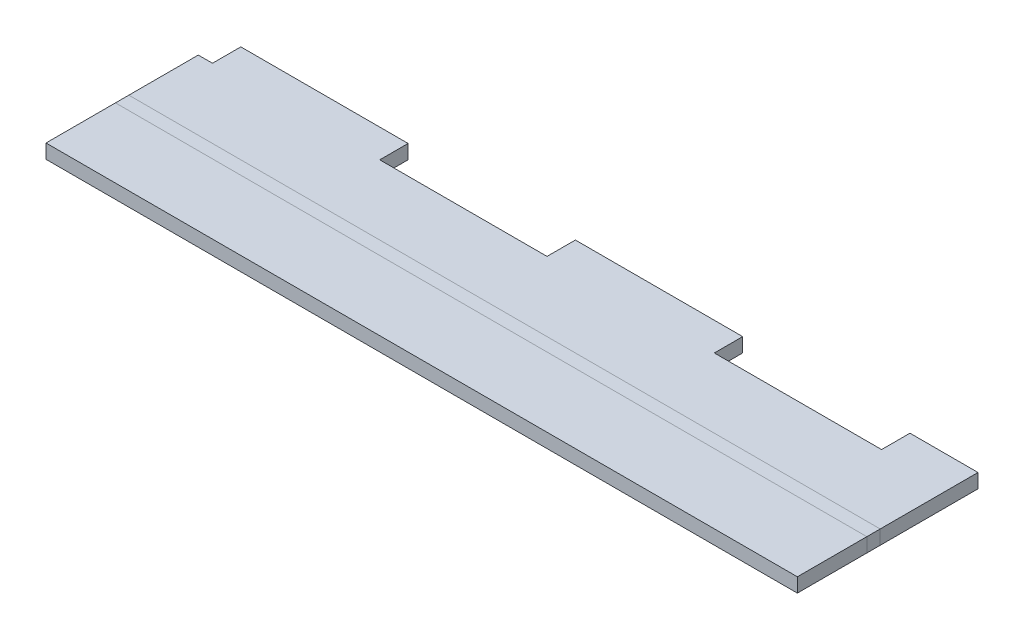
ISO-10303-21;
HEADER;
FILE_DESCRIPTION(('STEP AP214'),'2;1');
FILE_NAME('part.step','',(''),(''),'','','');
FILE_SCHEMA(('AUTOMOTIVE_DESIGN { 1 0 10303 214 1 1 1 1 }'));
ENDSEC;
DATA;
#1=APPLICATION_CONTEXT('core data for automotive mechanical design processes');
#2=APPLICATION_PROTOCOL_DEFINITION('international standard','automotive_design',2000,#1);
#3=PRODUCT_CONTEXT('',#1,'mechanical');
#4=PRODUCT('Part','Part','',(#3));
#5=PRODUCT_RELATED_PRODUCT_CATEGORY('part','',(#4));
#6=PRODUCT_DEFINITION_FORMATION('','',#4);
#7=PRODUCT_DEFINITION_CONTEXT('part definition',#1,'design');
#8=PRODUCT_DEFINITION('design','',#6,#7);
#9=PRODUCT_DEFINITION_SHAPE('','',#8);
#10=(LENGTH_UNIT() NAMED_UNIT(*) SI_UNIT(.MILLI.,.METRE.));
#11=(NAMED_UNIT(*) PLANE_ANGLE_UNIT() SI_UNIT($,.RADIAN.));
#12=(NAMED_UNIT(*) SI_UNIT($,.STERADIAN.) SOLID_ANGLE_UNIT());
#13=UNCERTAINTY_MEASURE_WITH_UNIT(LENGTH_MEASURE(1.E-05),#10,'distance_accuracy_value','');
#14=(GEOMETRIC_REPRESENTATION_CONTEXT(3) GLOBAL_UNCERTAINTY_ASSIGNED_CONTEXT((#13)) GLOBAL_UNIT_ASSIGNED_CONTEXT((#10,
#11,#12)) REPRESENTATION_CONTEXT('',''));
#15=CARTESIAN_POINT('',(0.,0.,0.));
#16=DIRECTION('',(0.,0.,1.));
#17=DIRECTION('',(1.,0.,0.));
#18=AXIS2_PLACEMENT_3D('',#15,#16,#17);
#19=CARTESIAN_POINT('',(6.731,2.032,-1.96658936020354));
#20=DIRECTION('',(1.,0.,0.));
#21=DIRECTION('',(0.,0.,1.));
#22=AXIS2_PLACEMENT_3D('',#19,#20,#21);
#23=PLANE('',#22);
#24=DIRECTION('',(0.,1.,0.));
#25=VECTOR('',#24,1.);
#26=CARTESIAN_POINT('',(6.731,2.032,-0.213989360203542));
#27=LINE('',#26,#25);
#28=CARTESIAN_POINT('',(6.731,1.778,-0.213989360203542));
#29=VERTEX_POINT('',#28);
#30=CARTESIAN_POINT('',(6.731,2.032,-0.213989360203542));
#31=VERTEX_POINT('',#30);
#32=EDGE_CURVE('E11',#29,#31,#27,.T.);
#33=ORIENTED_EDGE('',*,*,#32,.F.);
#34=DIRECTION('',(0.,0.,1.));
#35=VECTOR('',#34,1.);
#36=CARTESIAN_POINT('',(6.731,1.778,-1.96658936020354));
#37=LINE('',#36,#35);
#38=CARTESIAN_POINT('',(6.731,1.778,-1.96658936020354));
#39=VERTEX_POINT('',#38);
#40=EDGE_CURVE('E55',#39,#29,#37,.T.);
#41=ORIENTED_EDGE('',*,*,#40,.F.);
#42=DIRECTION('',(0.,1.,0.));
#43=VECTOR('',#42,1.);
#44=CARTESIAN_POINT('',(6.731,2.032,-1.96658936020354));
#45=LINE('',#44,#43);
#46=CARTESIAN_POINT('',(6.731,2.032,-1.96658936020354));
#47=VERTEX_POINT('',#46);
#48=EDGE_CURVE('E319',#39,#47,#45,.T.);
#49=ORIENTED_EDGE('',*,*,#48,.T.);
#50=DIRECTION('',(0.,0.,1.));
#51=VECTOR('',#50,1.);
#52=CARTESIAN_POINT('',(6.731,2.032,-1.96658936020354));
#53=LINE('',#52,#51);
#54=EDGE_CURVE('E238',#47,#31,#53,.T.);
#55=ORIENTED_EDGE('',*,*,#54,.T.);
#56=EDGE_LOOP('',(#33,#41,#49,#55));
#57=FACE_BOUND('',#56,.T.);
#58=ADVANCED_FACE('F41',(#57),#23,.T.);
#59=CARTESIAN_POINT('',(6.731,2.032,-1.96658936020354));
#60=DIRECTION('',(0.,0.,1.));
#61=DIRECTION('',(-1.,0.,0.));
#62=AXIS2_PLACEMENT_3D('',#59,#60,#61);
#63=PLANE('',#62);
#64=ORIENTED_EDGE('',*,*,#48,.F.);
#65=DIRECTION('',(1.,0.,0.));
#66=VECTOR('',#65,1.);
#67=CARTESIAN_POINT('',(6.731,1.778,-1.96658936020354));
#68=LINE('',#67,#66);
#69=CARTESIAN_POINT('',(5.51179999999999,1.778,-1.96658936020354));
#70=VERTEX_POINT('',#69);
#71=EDGE_CURVE('E293',#39,#70,#68,.F.);
#72=ORIENTED_EDGE('',*,*,#71,.T.);
#73=DIRECTION('',(0.,1.,0.));
#74=VECTOR('',#73,1.);
#75=CARTESIAN_POINT('',(5.51179999999999,2.032,-1.96658936020354));
#76=LINE('',#75,#74);
#77=CARTESIAN_POINT('',(5.51179999999999,2.032,-1.96658936020354));
#78=VERTEX_POINT('',#77);
#79=EDGE_CURVE('E317',#70,#78,#76,.T.);
#80=ORIENTED_EDGE('',*,*,#79,.T.);
#81=DIRECTION('',(-1.,0.,0.));
#82=VECTOR('',#81,1.);
#83=CARTESIAN_POINT('',(6.731,2.032,-1.96658936020354));
#84=LINE('',#83,#82);
#85=EDGE_CURVE('E241',#47,#78,#84,.T.);
#86=ORIENTED_EDGE('',*,*,#85,.F.);
#87=EDGE_LOOP('',(#64,#72,#80,#86));
#88=FACE_BOUND('',#87,.T.);
#89=ADVANCED_FACE('F352',(#88),#63,.F.);
#90=CARTESIAN_POINT('',(5.51179999999999,2.032,-1.96658936020354));
#91=DIRECTION('',(-1.,0.,0.));
#92=DIRECTION('',(0.,0.,-1.));
#93=AXIS2_PLACEMENT_3D('',#90,#91,#92);
#94=PLANE('',#93);
#95=ORIENTED_EDGE('',*,*,#79,.F.);
#96=DIRECTION('',(0.,0.,1.));
#97=VECTOR('',#96,1.);
#98=CARTESIAN_POINT('',(5.51179999999999,1.778,-1.96658936020354));
#99=LINE('',#98,#97);
#100=CARTESIAN_POINT('',(5.51179999999999,1.778,-1.45858936020354));
#101=VERTEX_POINT('',#100);
#102=EDGE_CURVE('E290',#101,#70,#99,.F.);
#103=ORIENTED_EDGE('',*,*,#102,.F.);
#104=DIRECTION('',(0.,1.,0.));
#105=VECTOR('',#104,1.);
#106=CARTESIAN_POINT('',(5.51179999999999,2.032,-1.45858936020354));
#107=LINE('',#106,#105);
#108=CARTESIAN_POINT('',(5.51179999999999,2.032,-1.45858936020354));
#109=VERTEX_POINT('',#108);
#110=EDGE_CURVE('E315',#101,#109,#107,.T.);
#111=ORIENTED_EDGE('',*,*,#110,.T.);
#112=DIRECTION('',(0.,0.,-1.));
#113=VECTOR('',#112,1.);
#114=CARTESIAN_POINT('',(5.51179999999999,2.032,-1.96658936020354));
#115=LINE('',#114,#113);
#116=EDGE_CURVE('E244',#109,#78,#115,.T.);
#117=ORIENTED_EDGE('',*,*,#116,.T.);
#118=EDGE_LOOP('',(#95,#103,#111,#117));
#119=FACE_BOUND('',#118,.T.);
#120=ADVANCED_FACE('F357',(#119),#94,.T.);
#121=CARTESIAN_POINT('',(5.51179999999999,2.032,-1.45858936020354));
#122=DIRECTION('',(0.,0.,-1.));
#123=DIRECTION('',(1.,0.,0.));
#124=AXIS2_PLACEMENT_3D('',#121,#122,#123);
#125=PLANE('',#124);
#126=ORIENTED_EDGE('',*,*,#110,.F.);
#127=DIRECTION('',(1.,0.,0.));
#128=VECTOR('',#127,1.);
#129=CARTESIAN_POINT('',(6.731,1.778,-1.45858936020354));
#130=LINE('',#129,#128);
#131=CARTESIAN_POINT('',(2.51459999999999,1.778,-1.45858936020354));
#132=VERTEX_POINT('',#131);
#133=EDGE_CURVE('E287',#132,#101,#130,.T.);
#134=ORIENTED_EDGE('',*,*,#133,.F.);
#135=DIRECTION('',(0.,1.,0.));
#136=VECTOR('',#135,1.);
#137=CARTESIAN_POINT('',(2.51459999999999,2.032,-1.45858936020354));
#138=LINE('',#137,#136);
#139=CARTESIAN_POINT('',(2.51459999999999,2.032,-1.45858936020354));
#140=VERTEX_POINT('',#139);
#141=EDGE_CURVE('E313',#132,#140,#138,.T.);
#142=ORIENTED_EDGE('',*,*,#141,.T.);
#143=DIRECTION('',(1.,0.,0.));
#144=VECTOR('',#143,1.);
#145=CARTESIAN_POINT('',(5.51179999999999,2.032,-1.45858936020354));
#146=LINE('',#145,#144);
#147=EDGE_CURVE('E249',#140,#109,#146,.T.);
#148=ORIENTED_EDGE('',*,*,#147,.T.);
#149=EDGE_LOOP('',(#126,#134,#142,#148));
#150=FACE_BOUND('',#149,.T.);
#151=ADVANCED_FACE('F373',(#150),#125,.T.);
#152=CARTESIAN_POINT('',(2.51459999999999,2.032,-1.96658936020354));
#153=DIRECTION('',(1.,0.,0.));
#154=DIRECTION('',(0.,0.,1.));
#155=AXIS2_PLACEMENT_3D('',#152,#153,#154);
#156=PLANE('',#155);
#157=ORIENTED_EDGE('',*,*,#141,.F.);
#158=DIRECTION('',(0.,0.,1.));
#159=VECTOR('',#158,1.);
#160=CARTESIAN_POINT('',(2.51459999999999,1.778,-1.96658936020354));
#161=LINE('',#160,#159);
#162=CARTESIAN_POINT('',(2.51459999999999,1.778,-1.96658936020354));
#163=VERTEX_POINT('',#162);
#164=EDGE_CURVE('E284',#163,#132,#161,.T.);
#165=ORIENTED_EDGE('',*,*,#164,.F.);
#166=DIRECTION('',(0.,1.,0.));
#167=VECTOR('',#166,1.);
#168=CARTESIAN_POINT('',(2.51459999999999,2.032,-1.96658936020354));
#169=LINE('',#168,#167);
#170=CARTESIAN_POINT('',(2.51459999999999,2.032,-1.96658936020354));
#171=VERTEX_POINT('',#170);
#172=EDGE_CURVE('E311',#163,#171,#169,.T.);
#173=ORIENTED_EDGE('',*,*,#172,.T.);
#174=DIRECTION('',(0.,0.,1.));
#175=VECTOR('',#174,1.);
#176=CARTESIAN_POINT('',(2.51459999999999,2.032,-1.96658936020354));
#177=LINE('',#176,#175);
#178=EDGE_CURVE('E252',#171,#140,#177,.T.);
#179=ORIENTED_EDGE('',*,*,#178,.T.);
#180=EDGE_LOOP('',(#157,#165,#173,#179));
#181=FACE_BOUND('',#180,.T.);
#182=ADVANCED_FACE('F379',(#181),#156,.T.);
#183=ORIENTED_EDGE('',*,*,#172,.F.);
#184=DIRECTION('',(1.,0.,0.));
#185=VECTOR('',#184,1.);
#186=CARTESIAN_POINT('',(6.731,1.778,-1.96658936020354));
#187=LINE('',#186,#185);
#188=CARTESIAN_POINT('',(-0.482600000000006,1.778,-1.96658936020354));
#189=VERTEX_POINT('',#188);
#190=EDGE_CURVE('E281',#163,#189,#187,.F.);
#191=ORIENTED_EDGE('',*,*,#190,.T.);
#192=DIRECTION('',(0.,1.,0.));
#193=VECTOR('',#192,1.);
#194=CARTESIAN_POINT('',(-0.482600000000006,2.032,-1.96658936020354));
#195=LINE('',#194,#193);
#196=CARTESIAN_POINT('',(-0.482600000000006,2.032,-1.96658936020354));
#197=VERTEX_POINT('',#196);
#198=EDGE_CURVE('E309',#189,#197,#195,.T.);
#199=ORIENTED_EDGE('',*,*,#198,.T.);
#200=EDGE_CURVE('E246',#171,#197,#84,.T.);
#201=ORIENTED_EDGE('',*,*,#200,.F.);
#202=EDGE_LOOP('',(#183,#191,#199,#201));
#203=FACE_BOUND('',#202,.T.);
#204=ADVANCED_FACE('F360',(#203),#63,.F.);
#205=CARTESIAN_POINT('',(-0.482600000000006,2.032,-1.96658936020354));
#206=DIRECTION('',(-1.,0.,0.));
#207=DIRECTION('',(0.,0.,-1.));
#208=AXIS2_PLACEMENT_3D('',#205,#206,#207);
#209=PLANE('',#208);
#210=ORIENTED_EDGE('',*,*,#198,.F.);
#211=DIRECTION('',(0.,0.,1.));
#212=VECTOR('',#211,1.);
#213=CARTESIAN_POINT('',(-0.482600000000006,1.778,-1.96658936020354));
#214=LINE('',#213,#212);
#215=CARTESIAN_POINT('',(-0.482600000000006,1.778,-1.45858936020354));
#216=VERTEX_POINT('',#215);
#217=EDGE_CURVE('E278',#216,#189,#214,.F.);
#218=ORIENTED_EDGE('',*,*,#217,.F.);
#219=DIRECTION('',(0.,1.,0.));
#220=VECTOR('',#219,1.);
#221=CARTESIAN_POINT('',(-0.482600000000005,2.032,-1.45858936020354));
#222=LINE('',#221,#220);
#223=CARTESIAN_POINT('',(-0.482600000000005,2.032,-1.45858936020354));
#224=VERTEX_POINT('',#223);
#225=EDGE_CURVE('E307',#216,#224,#222,.T.);
#226=ORIENTED_EDGE('',*,*,#225,.T.);
#227=DIRECTION('',(0.,0.,-1.));
#228=VECTOR('',#227,1.);
#229=CARTESIAN_POINT('',(-0.482600000000006,2.032,-1.96658936020354));
#230=LINE('',#229,#228);
#231=EDGE_CURVE('E255',#224,#197,#230,.T.);
#232=ORIENTED_EDGE('',*,*,#231,.T.);
#233=EDGE_LOOP('',(#210,#218,#226,#232));
#234=FACE_BOUND('',#233,.T.);
#235=ADVANCED_FACE('F384',(#234),#209,.T.);
#236=CARTESIAN_POINT('',(-0.482600000000005,2.032,-1.45858936020354));
#237=DIRECTION('',(0.,0.,-1.));
#238=DIRECTION('',(1.,0.,0.));
#239=AXIS2_PLACEMENT_3D('',#236,#237,#238);
#240=PLANE('',#239);
#241=ORIENTED_EDGE('',*,*,#225,.F.);
#242=DIRECTION('',(1.,0.,0.));
#243=VECTOR('',#242,1.);
#244=CARTESIAN_POINT('',(6.731,1.778,-1.45858936020354));
#245=LINE('',#244,#243);
#246=CARTESIAN_POINT('',(-3.47980000000001,1.778,-1.45858936020354));
#247=VERTEX_POINT('',#246);
#248=EDGE_CURVE('E275',#247,#216,#245,.T.);
#249=ORIENTED_EDGE('',*,*,#248,.F.);
#250=DIRECTION('',(0.,1.,0.));
#251=VECTOR('',#250,1.);
#252=CARTESIAN_POINT('',(-3.47980000000001,2.032,-1.45858936020354));
#253=LINE('',#252,#251);
#254=CARTESIAN_POINT('',(-3.47980000000001,2.032,-1.45858936020354));
#255=VERTEX_POINT('',#254);
#256=EDGE_CURVE('E305',#247,#255,#253,.T.);
#257=ORIENTED_EDGE('',*,*,#256,.T.);
#258=DIRECTION('',(1.,0.,0.));
#259=VECTOR('',#258,1.);
#260=CARTESIAN_POINT('',(-0.482600000000005,2.032,-1.45858936020354));
#261=LINE('',#260,#259);
#262=EDGE_CURVE('E258',#255,#224,#261,.T.);
#263=ORIENTED_EDGE('',*,*,#262,.T.);
#264=EDGE_LOOP('',(#241,#249,#257,#263));
#265=FACE_BOUND('',#264,.T.);
#266=ADVANCED_FACE('F402',(#265),#240,.T.);
#267=CARTESIAN_POINT('',(-3.47980000000001,2.032,-1.96658936020354));
#268=DIRECTION('',(1.,0.,0.));
#269=DIRECTION('',(0.,0.,1.));
#270=AXIS2_PLACEMENT_3D('',#267,#268,#269);
#271=PLANE('',#270);
#272=ORIENTED_EDGE('',*,*,#256,.F.);
#273=DIRECTION('',(0.,0.,1.));
#274=VECTOR('',#273,1.);
#275=CARTESIAN_POINT('',(-3.47980000000001,1.778,-1.96658936020354));
#276=LINE('',#275,#274);
#277=CARTESIAN_POINT('',(-3.47980000000001,1.778,-1.96658936020354));
#278=VERTEX_POINT('',#277);
#279=EDGE_CURVE('E272',#278,#247,#276,.T.);
#280=ORIENTED_EDGE('',*,*,#279,.F.);
#281=DIRECTION('',(0.,1.,0.));
#282=VECTOR('',#281,1.);
#283=CARTESIAN_POINT('',(-3.47980000000001,2.032,-1.96658936020354));
#284=LINE('',#283,#282);
#285=CARTESIAN_POINT('',(-3.47980000000001,2.032,-1.96658936020354));
#286=VERTEX_POINT('',#285);
#287=EDGE_CURVE('E303',#278,#286,#284,.T.);
#288=ORIENTED_EDGE('',*,*,#287,.T.);
#289=DIRECTION('',(0.,0.,1.));
#290=VECTOR('',#289,1.);
#291=CARTESIAN_POINT('',(-3.47980000000001,2.032,-1.96658936020354));
#292=LINE('',#291,#290);
#293=EDGE_CURVE('E261',#286,#255,#292,.T.);
#294=ORIENTED_EDGE('',*,*,#293,.T.);
#295=EDGE_LOOP('',(#272,#280,#288,#294));
#296=FACE_BOUND('',#295,.T.);
#297=ADVANCED_FACE('F400',(#296),#271,.T.);
#298=ORIENTED_EDGE('',*,*,#287,.F.);
#299=DIRECTION('',(1.,0.,0.));
#300=VECTOR('',#299,1.);
#301=CARTESIAN_POINT('',(6.731,1.778,-1.96658936020354));
#302=LINE('',#301,#300);
#303=CARTESIAN_POINT('',(-6.477,1.778,-1.96658936020354));
#304=VERTEX_POINT('',#303);
#305=EDGE_CURVE('E233',#278,#304,#302,.F.);
#306=ORIENTED_EDGE('',*,*,#305,.T.);
#307=DIRECTION('',(0.,1.,0.));
#308=VECTOR('',#307,1.);
#309=CARTESIAN_POINT('',(-6.47700000000001,2.032,-1.96658936020354));
#310=LINE('',#309,#308);
#311=CARTESIAN_POINT('',(-6.47700000000001,2.032,-1.96658936020354));
#312=VERTEX_POINT('',#311);
#313=EDGE_CURVE('E301',#304,#312,#310,.T.);
#314=ORIENTED_EDGE('',*,*,#313,.T.);
#315=EDGE_CURVE('E245',#286,#312,#84,.T.);
#316=ORIENTED_EDGE('',*,*,#315,.F.);
#317=EDGE_LOOP('',(#298,#306,#314,#316));
#318=FACE_BOUND('',#317,.T.);
#319=ADVANCED_FACE('F361',(#318),#63,.F.);
#320=CARTESIAN_POINT('',(-6.47700000000001,2.032,-1.96658936020354));
#321=DIRECTION('',(-1.,0.,0.));
#322=DIRECTION('',(0.,0.,-1.));
#323=AXIS2_PLACEMENT_3D('',#320,#321,#322);
#324=PLANE('',#323);
#325=ORIENTED_EDGE('',*,*,#313,.F.);
#326=DIRECTION('',(0.,0.,1.));
#327=VECTOR('',#326,1.);
#328=CARTESIAN_POINT('',(-6.477,1.778,-1.96658936020354));
#329=LINE('',#328,#327);
#330=CARTESIAN_POINT('',(-6.477,1.778,-1.45858936020354));
#331=VERTEX_POINT('',#330);
#332=EDGE_CURVE('E215',#331,#304,#329,.F.);
#333=ORIENTED_EDGE('',*,*,#332,.F.);
#334=DIRECTION('',(0.,1.,0.));
#335=VECTOR('',#334,1.);
#336=CARTESIAN_POINT('',(-6.47700000000001,2.032,-1.45858936020354));
#337=LINE('',#336,#335);
#338=CARTESIAN_POINT('',(-6.47700000000001,2.032,-1.45858936020354));
#339=VERTEX_POINT('',#338);
#340=EDGE_CURVE('E299',#331,#339,#337,.T.);
#341=ORIENTED_EDGE('',*,*,#340,.T.);
#342=DIRECTION('',(0.,0.,-1.));
#343=VECTOR('',#342,1.);
#344=CARTESIAN_POINT('',(-6.47700000000001,2.032,-1.96658936020354));
#345=LINE('',#344,#343);
#346=EDGE_CURVE('E229',#339,#312,#345,.T.);
#347=ORIENTED_EDGE('',*,*,#346,.T.);
#348=EDGE_LOOP('',(#325,#333,#341,#347));
#349=FACE_BOUND('',#348,.T.);
#350=ADVANCED_FACE('F393',(#349),#324,.T.);
#351=CARTESIAN_POINT('',(-6.47700000000001,2.032,-1.45858936020354));
#352=DIRECTION('',(0.,0.,-1.));
#353=DIRECTION('',(1.,0.,0.));
#354=AXIS2_PLACEMENT_3D('',#351,#352,#353);
#355=PLANE('',#354);
#356=ORIENTED_EDGE('',*,*,#340,.F.);
#357=DIRECTION('',(1.,0.,0.));
#358=VECTOR('',#357,1.);
#359=CARTESIAN_POINT('',(6.731,1.778,-1.45858936020354));
#360=LINE('',#359,#358);
#361=CARTESIAN_POINT('',(-6.731,1.778,-1.45858936020354));
#362=VERTEX_POINT('',#361);
#363=EDGE_CURVE('E265',#362,#331,#360,.T.);
#364=ORIENTED_EDGE('',*,*,#363,.F.);
#365=DIRECTION('',(0.,1.,0.));
#366=VECTOR('',#365,1.);
#367=CARTESIAN_POINT('',(-6.731,2.032,-1.45858936020354));
#368=LINE('',#367,#366);
#369=CARTESIAN_POINT('',(-6.731,2.032,-1.45858936020354));
#370=VERTEX_POINT('',#369);
#371=EDGE_CURVE('E297',#362,#370,#368,.T.);
#372=ORIENTED_EDGE('',*,*,#371,.T.);
#373=DIRECTION('',(1.,0.,0.));
#374=VECTOR('',#373,1.);
#375=CARTESIAN_POINT('',(-6.47700000000001,2.032,-1.45858936020354));
#376=LINE('',#375,#374);
#377=EDGE_CURVE('E232',#370,#339,#376,.T.);
#378=ORIENTED_EDGE('',*,*,#377,.T.);
#379=EDGE_LOOP('',(#356,#364,#372,#378));
#380=FACE_BOUND('',#379,.T.);
#381=ADVANCED_FACE('F396',(#380),#355,.T.);
#382=CARTESIAN_POINT('',(-6.731,2.032,-1.96658936020354));
#383=DIRECTION('',(1.,0.,0.));
#384=DIRECTION('',(0.,0.,1.));
#385=AXIS2_PLACEMENT_3D('',#382,#383,#384);
#386=PLANE('',#385);
#387=ORIENTED_EDGE('',*,*,#371,.F.);
#388=DIRECTION('',(0.,0.,1.));
#389=VECTOR('',#388,1.);
#390=CARTESIAN_POINT('',(-6.731,1.778,-1.96658936020354));
#391=LINE('',#390,#389);
#392=CARTESIAN_POINT('',(-6.731,1.778,-0.213989360203542));
#393=VERTEX_POINT('',#392);
#394=EDGE_CURVE('E63',#362,#393,#391,.T.);
#395=ORIENTED_EDGE('',*,*,#394,.T.);
#396=DIRECTION('',(0.,1.,0.));
#397=VECTOR('',#396,1.);
#398=CARTESIAN_POINT('',(-6.731,2.032,-0.213989360203542));
#399=LINE('',#398,#397);
#400=CARTESIAN_POINT('',(-6.731,2.032,-0.213989360203542));
#401=VERTEX_POINT('',#400);
#402=EDGE_CURVE('E322',#393,#401,#399,.T.);
#403=ORIENTED_EDGE('',*,*,#402,.T.);
#404=DIRECTION('',(0.,0.,1.));
#405=VECTOR('',#404,1.);
#406=CARTESIAN_POINT('',(-6.731,2.032,-1.96658936020354));
#407=LINE('',#406,#405);
#408=EDGE_CURVE('E236',#370,#401,#407,.T.);
#409=ORIENTED_EDGE('',*,*,#408,.F.);
#410=EDGE_LOOP('',(#387,#395,#403,#409));
#411=FACE_BOUND('',#410,.T.);
#412=ADVANCED_FACE('F476',(#411),#386,.F.);
#413=CARTESIAN_POINT('',(6.731,2.032,-1.96658936020354));
#414=DIRECTION('',(0.,-1.,0.));
#415=DIRECTION('',(1.,0.,0.));
#416=AXIS2_PLACEMENT_3D('',#413,#414,#415);
#417=PLANE('',#416);
#418=ORIENTED_EDGE('',*,*,#346,.F.);
#419=ORIENTED_EDGE('',*,*,#377,.F.);
#420=ORIENTED_EDGE('',*,*,#408,.T.);
#421=DIRECTION('',(-1.,0.,0.));
#422=VECTOR('',#421,1.);
#423=CARTESIAN_POINT('',(6.731,2.032,-0.213989360203542));
#424=LINE('',#423,#422);
#425=EDGE_CURVE('E205',#31,#401,#424,.T.);
#426=ORIENTED_EDGE('',*,*,#425,.F.);
#427=ORIENTED_EDGE('',*,*,#54,.F.);
#428=ORIENTED_EDGE('',*,*,#85,.T.);
#429=ORIENTED_EDGE('',*,*,#116,.F.);
#430=ORIENTED_EDGE('',*,*,#147,.F.);
#431=ORIENTED_EDGE('',*,*,#178,.F.);
#432=ORIENTED_EDGE('',*,*,#200,.T.);
#433=ORIENTED_EDGE('',*,*,#231,.F.);
#434=ORIENTED_EDGE('',*,*,#262,.F.);
#435=ORIENTED_EDGE('',*,*,#293,.F.);
#436=ORIENTED_EDGE('',*,*,#315,.T.);
#437=EDGE_LOOP('',(#418,#419,#420,#426,#427,#428,#429,#430,#431,#432,#433,#434,#435,#436));
#438=FACE_BOUND('',#437,.T.);
#439=ADVANCED_FACE('F348',(#438),#417,.F.);
#440=CARTESIAN_POINT('',(6.731,1.778,-1.96658936020354));
#441=DIRECTION('',(0.,-1.,0.));
#442=DIRECTION('',(1.,0.,0.));
#443=AXIS2_PLACEMENT_3D('',#440,#441,#442);
#444=PLANE('',#443);
#445=ORIENTED_EDGE('',*,*,#332,.T.);
#446=ORIENTED_EDGE('',*,*,#305,.F.);
#447=ORIENTED_EDGE('',*,*,#279,.T.);
#448=ORIENTED_EDGE('',*,*,#248,.T.);
#449=ORIENTED_EDGE('',*,*,#217,.T.);
#450=ORIENTED_EDGE('',*,*,#190,.F.);
#451=ORIENTED_EDGE('',*,*,#164,.T.);
#452=ORIENTED_EDGE('',*,*,#133,.T.);
#453=ORIENTED_EDGE('',*,*,#102,.T.);
#454=ORIENTED_EDGE('',*,*,#71,.F.);
#455=ORIENTED_EDGE('',*,*,#40,.T.);
#456=DIRECTION('',(-1.,0.,0.));
#457=VECTOR('',#456,1.);
#458=CARTESIAN_POINT('',(6.731,1.778,-0.213989360203542));
#459=LINE('',#458,#457);
#460=EDGE_CURVE('E48',#29,#393,#459,.T.);
#461=ORIENTED_EDGE('',*,*,#460,.T.);
#462=ORIENTED_EDGE('',*,*,#394,.F.);
#463=ORIENTED_EDGE('',*,*,#363,.T.);
#464=EDGE_LOOP('',(#445,#446,#447,#448,#449,#450,#451,#452,#453,#454,#455,#461,#462,#463));
#465=FACE_BOUND('',#464,.T.);
#466=ADVANCED_FACE('F324',(#465),#444,.T.);
#467=CARTESIAN_POINT('',(6.731,2.032,1.27));
#468=DIRECTION('',(0.,0.,1.));
#469=DIRECTION('',(-1.,0.,0.));
#470=AXIS2_PLACEMENT_3D('',#467,#468,#469);
#471=PLANE('',#470);
#472=DIRECTION('',(0.,1.,0.));
#473=VECTOR('',#472,1.);
#474=CARTESIAN_POINT('',(-6.731,2.032,1.27));
#475=LINE('',#474,#473);
#476=CARTESIAN_POINT('',(-6.731,1.778,1.27));
#477=VERTEX_POINT('',#476);
#478=CARTESIAN_POINT('',(-6.731,2.032,1.27));
#479=VERTEX_POINT('',#478);
#480=EDGE_CURVE('E189',#477,#479,#475,.T.);
#481=ORIENTED_EDGE('',*,*,#480,.F.);
#482=DIRECTION('',(1.,0.,0.));
#483=VECTOR('',#482,1.);
#484=CARTESIAN_POINT('',(6.731,1.778,1.27));
#485=LINE('',#484,#483);
#486=CARTESIAN_POINT('',(6.731,1.778,1.27));
#487=VERTEX_POINT('',#486);
#488=EDGE_CURVE('E218',#487,#477,#485,.F.);
#489=ORIENTED_EDGE('',*,*,#488,.F.);
#490=DIRECTION('',(0.,1.,0.));
#491=VECTOR('',#490,1.);
#492=CARTESIAN_POINT('',(6.731,2.032,1.27));
#493=LINE('',#492,#491);
#494=CARTESIAN_POINT('',(6.731,2.032,1.27));
#495=VERTEX_POINT('',#494);
#496=EDGE_CURVE('E201',#487,#495,#493,.T.);
#497=ORIENTED_EDGE('',*,*,#496,.T.);
#498=DIRECTION('',(-1.,0.,0.));
#499=VECTOR('',#498,1.);
#500=CARTESIAN_POINT('',(6.731,2.032,1.27));
#501=LINE('',#500,#499);
#502=EDGE_CURVE('E190',#495,#479,#501,.T.);
#503=ORIENTED_EDGE('',*,*,#502,.T.);
#504=EDGE_LOOP('',(#481,#489,#497,#503));
#505=FACE_BOUND('',#504,.T.);
#506=ADVANCED_FACE('F340',(#505),#471,.T.);
#507=CARTESIAN_POINT('',(6.731,2.032,0.0254));
#508=DIRECTION('',(0.,-1.,0.));
#509=DIRECTION('',(0.,0.,-1.));
#510=AXIS2_PLACEMENT_3D('',#507,#508,#509);
#511=PLANE('',#510);
#512=DIRECTION('',(0.,0.,1.));
#513=VECTOR('',#512,1.);
#514=CARTESIAN_POINT('',(-6.731,2.032,0.0254));
#515=LINE('',#514,#513);
#516=CARTESIAN_POINT('',(-6.731,2.032,0.0254));
#517=VERTEX_POINT('',#516);
#518=EDGE_CURVE('E171',#517,#479,#515,.T.);
#519=ORIENTED_EDGE('',*,*,#518,.T.);
#520=ORIENTED_EDGE('',*,*,#502,.F.);
#521=DIRECTION('',(0.,0.,1.));
#522=VECTOR('',#521,1.);
#523=CARTESIAN_POINT('',(6.731,2.032,0.0254));
#524=LINE('',#523,#522);
#525=CARTESIAN_POINT('',(6.731,2.032,0.0254));
#526=VERTEX_POINT('',#525);
#527=EDGE_CURVE('E174',#526,#495,#524,.T.);
#528=ORIENTED_EDGE('',*,*,#527,.F.);
#529=DIRECTION('',(-1.,0.,0.));
#530=VECTOR('',#529,1.);
#531=CARTESIAN_POINT('',(6.731,2.032,0.0254));
#532=LINE('',#531,#530);
#533=EDGE_CURVE('E167',#526,#517,#532,.T.);
#534=ORIENTED_EDGE('',*,*,#533,.T.);
#535=EDGE_LOOP('',(#519,#520,#528,#534));
#536=FACE_BOUND('',#535,.T.);
#537=ADVANCED_FACE('F169',(#536),#511,.F.);
#538=CARTESIAN_POINT('',(-6.731,2.032,0.0254));
#539=DIRECTION('',(1.,0.,0.));
#540=DIRECTION('',(0.,0.,1.));
#541=AXIS2_PLACEMENT_3D('',#538,#539,#540);
#542=PLANE('',#541);
#543=DIRECTION('',(0.,0.,-1.));
#544=VECTOR('',#543,1.);
#545=CARTESIAN_POINT('',(-6.731,1.778,0.0254));
#546=LINE('',#545,#544);
#547=CARTESIAN_POINT('',(-6.731,1.778,0.0254));
#548=VERTEX_POINT('',#547);
#549=EDGE_CURVE('E180',#548,#477,#546,.F.);
#550=ORIENTED_EDGE('',*,*,#549,.T.);
#551=ORIENTED_EDGE('',*,*,#480,.T.);
#552=ORIENTED_EDGE('',*,*,#518,.F.);
#553=DIRECTION('',(0.,1.,0.));
#554=VECTOR('',#553,1.);
#555=CARTESIAN_POINT('',(-6.731,2.032,0.0254));
#556=LINE('',#555,#554);
#557=EDGE_CURVE('E187',#548,#517,#556,.T.);
#558=ORIENTED_EDGE('',*,*,#557,.F.);
#559=EDGE_LOOP('',(#550,#551,#552,#558));
#560=FACE_BOUND('',#559,.T.);
#561=ADVANCED_FACE('F186',(#560),#542,.F.);
#562=CARTESIAN_POINT('',(6.731,1.778,0.0254));
#563=DIRECTION('',(0.,-1.,0.));
#564=DIRECTION('',(0.,0.,-1.));
#565=AXIS2_PLACEMENT_3D('',#562,#563,#564);
#566=PLANE('',#565);
#567=ORIENTED_EDGE('',*,*,#549,.F.);
#568=DIRECTION('',(-1.,0.,0.));
#569=VECTOR('',#568,1.);
#570=CARTESIAN_POINT('',(6.731,1.778,0.0254));
#571=LINE('',#570,#569);
#572=CARTESIAN_POINT('',(6.731,1.778,0.0254));
#573=VERTEX_POINT('',#572);
#574=EDGE_CURVE('E202',#573,#548,#571,.T.);
#575=ORIENTED_EDGE('',*,*,#574,.F.);
#576=DIRECTION('',(0.,0.,-1.));
#577=VECTOR('',#576,1.);
#578=CARTESIAN_POINT('',(6.731,1.778,0.0254));
#579=LINE('',#578,#577);
#580=EDGE_CURVE('E221',#573,#487,#579,.F.);
#581=ORIENTED_EDGE('',*,*,#580,.T.);
#582=ORIENTED_EDGE('',*,*,#488,.T.);
#583=EDGE_LOOP('',(#567,#575,#581,#582));
#584=FACE_BOUND('',#583,.T.);
#585=ADVANCED_FACE('F333',(#584),#566,.T.);
#586=CARTESIAN_POINT('',(6.731,2.032,0.0254));
#587=DIRECTION('',(1.,0.,0.));
#588=DIRECTION('',(0.,0.,1.));
#589=AXIS2_PLACEMENT_3D('',#586,#587,#588);
#590=PLANE('',#589);
#591=ORIENTED_EDGE('',*,*,#496,.F.);
#592=ORIENTED_EDGE('',*,*,#580,.F.);
#593=DIRECTION('',(0.,1.,0.));
#594=VECTOR('',#593,1.);
#595=CARTESIAN_POINT('',(6.731,2.032,0.0254));
#596=LINE('',#595,#594);
#597=EDGE_CURVE('E216',#573,#526,#596,.T.);
#598=ORIENTED_EDGE('',*,*,#597,.T.);
#599=ORIENTED_EDGE('',*,*,#527,.T.);
#600=EDGE_LOOP('',(#591,#592,#598,#599));
#601=FACE_BOUND('',#600,.T.);
#602=ADVANCED_FACE('F338',(#601),#590,.T.);
#603=CARTESIAN_POINT('',(-6.731,2.032,-0.213989360203542));
#604=DIRECTION('',(-1.,0.,0.));
#605=DIRECTION('',(0.,0.,1.));
#606=AXIS2_PLACEMENT_3D('',#603,#604,#605);
#607=PLANE('',#606);
#608=ORIENTED_EDGE('',*,*,#402,.F.);
#609=DIRECTION('',(0.,0.,1.));
#610=VECTOR('',#609,1.);
#611=CARTESIAN_POINT('',(-6.731,1.778,-0.0942946801017711));
#612=LINE('',#611,#610);
#613=EDGE_CURVE('E200',#393,#548,#612,.T.);
#614=ORIENTED_EDGE('',*,*,#613,.T.);
#615=ORIENTED_EDGE('',*,*,#557,.T.);
#616=DIRECTION('',(0.,0.,1.));
#617=VECTOR('',#616,1.);
#618=CARTESIAN_POINT('',(-6.731,2.032,-0.213989360203542));
#619=LINE('',#618,#617);
#620=EDGE_CURVE('E197',#401,#517,#619,.T.);
#621=ORIENTED_EDGE('',*,*,#620,.F.);
#622=EDGE_LOOP('',(#608,#614,#615,#621));
#623=FACE_BOUND('',#622,.T.);
#624=ADVANCED_FACE('F196',(#623),#607,.T.);
#625=CARTESIAN_POINT('',(6.731,2.032,-0.213989360203542));
#626=DIRECTION('',(1.,0.,0.));
#627=DIRECTION('',(0.,0.,-1.));
#628=AXIS2_PLACEMENT_3D('',#625,#626,#627);
#629=PLANE('',#628);
#630=ORIENTED_EDGE('',*,*,#597,.F.);
#631=DIRECTION('',(0.,0.,1.));
#632=VECTOR('',#631,1.);
#633=CARTESIAN_POINT('',(6.731,1.778,-0.0942946801017711));
#634=LINE('',#633,#632);
#635=EDGE_CURVE('E207',#573,#29,#634,.F.);
#636=ORIENTED_EDGE('',*,*,#635,.T.);
#637=ORIENTED_EDGE('',*,*,#32,.T.);
#638=DIRECTION('',(0.,0.,-1.));
#639=VECTOR('',#638,1.);
#640=CARTESIAN_POINT('',(6.731,2.032,-0.213989360203542));
#641=LINE('',#640,#639);
#642=EDGE_CURVE('E206',#526,#31,#641,.T.);
#643=ORIENTED_EDGE('',*,*,#642,.F.);
#644=EDGE_LOOP('',(#630,#636,#637,#643));
#645=FACE_BOUND('',#644,.T.);
#646=ADVANCED_FACE('F336',(#645),#629,.T.);
#647=CARTESIAN_POINT('',(0.,2.032,-0.0942946801017711));
#648=DIRECTION('',(0.,1.,0.));
#649=DIRECTION('',(0.,0.,1.));
#650=AXIS2_PLACEMENT_3D('',#647,#648,#649);
#651=PLANE('',#650);
#652=ORIENTED_EDGE('',*,*,#642,.T.);
#653=ORIENTED_EDGE('',*,*,#425,.T.);
#654=ORIENTED_EDGE('',*,*,#620,.T.);
#655=ORIENTED_EDGE('',*,*,#533,.F.);
#656=EDGE_LOOP('',(#652,#653,#654,#655));
#657=FACE_BOUND('',#656,.T.);
#658=ADVANCED_FACE('F204',(#657),#651,.T.);
#659=CARTESIAN_POINT('',(0.,1.778,-0.0942946801017711));
#660=DIRECTION('',(0.,1.,0.));
#661=DIRECTION('',(0.,0.,1.));
#662=AXIS2_PLACEMENT_3D('',#659,#660,#661);
#663=PLANE('',#662);
#664=ORIENTED_EDGE('',*,*,#635,.F.);
#665=ORIENTED_EDGE('',*,*,#574,.T.);
#666=ORIENTED_EDGE('',*,*,#613,.F.);
#667=ORIENTED_EDGE('',*,*,#460,.F.);
#668=EDGE_LOOP('',(#664,#665,#666,#667));
#669=FACE_BOUND('',#668,.T.);
#670=ADVANCED_FACE('F329',(#669),#663,.F.);
#671=CLOSED_SHELL('',(#58,#89,#120,#151,#182,#204,#235,#266,#297,#319,#350,#381,#412,#439,#466,
#506,#537,#561,#585,#602,#624,#646,#658,#670));
#672=MANIFOLD_SOLID_BREP('B2',#671);
#673=ADVANCED_BREP_SHAPE_REPRESENTATION('',(#18,#672),#14);
#674=SHAPE_DEFINITION_REPRESENTATION(#9,#673);
ENDSEC;
END-ISO-10303-21;
